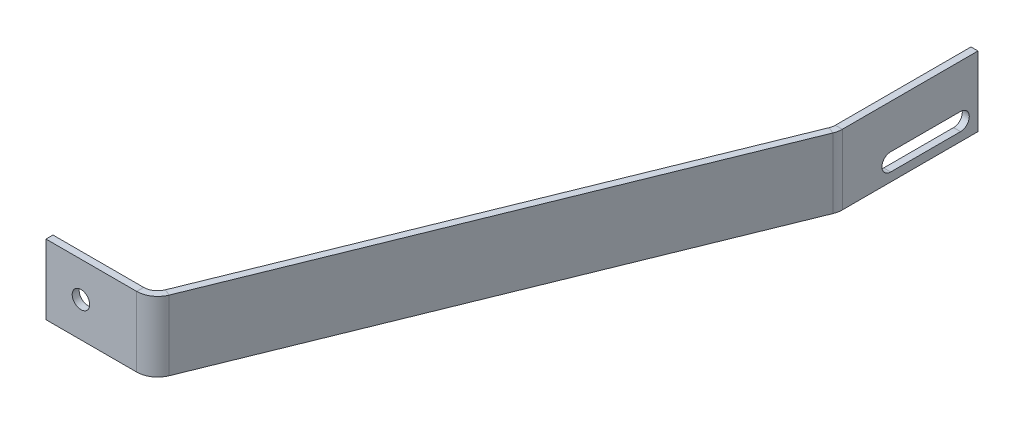
ISO-10303-21;
HEADER;
FILE_DESCRIPTION(('STEP AP214'),'2;1');
FILE_NAME('part.step','',(''),(''),'','','');
FILE_SCHEMA(('AUTOMOTIVE_DESIGN { 1 0 10303 214 1 1 1 1 }'));
ENDSEC;
DATA;
#1=APPLICATION_CONTEXT('core data for automotive mechanical design processes');
#2=APPLICATION_PROTOCOL_DEFINITION('international standard','automotive_design',2000,#1);
#3=PRODUCT_CONTEXT('',#1,'mechanical');
#4=PRODUCT('Part','Part','',(#3));
#5=PRODUCT_RELATED_PRODUCT_CATEGORY('part','',(#4));
#6=PRODUCT_DEFINITION_FORMATION('','',#4);
#7=PRODUCT_DEFINITION_CONTEXT('part definition',#1,'design');
#8=PRODUCT_DEFINITION('design','',#6,#7);
#9=PRODUCT_DEFINITION_SHAPE('','',#8);
#10=(LENGTH_UNIT() NAMED_UNIT(*) SI_UNIT(.MILLI.,.METRE.));
#11=(NAMED_UNIT(*) PLANE_ANGLE_UNIT() SI_UNIT($,.RADIAN.));
#12=(NAMED_UNIT(*) SI_UNIT($,.STERADIAN.) SOLID_ANGLE_UNIT());
#13=UNCERTAINTY_MEASURE_WITH_UNIT(LENGTH_MEASURE(1.E-05),#10,'distance_accuracy_value','');
#14=(GEOMETRIC_REPRESENTATION_CONTEXT(3) GLOBAL_UNCERTAINTY_ASSIGNED_CONTEXT((#13)) GLOBAL_UNIT_ASSIGNED_CONTEXT((#10,
#11,#12)) REPRESENTATION_CONTEXT('',''));
#15=CARTESIAN_POINT('',(0.,0.,0.));
#16=DIRECTION('',(0.,0.,1.));
#17=DIRECTION('',(1.,0.,0.));
#18=AXIS2_PLACEMENT_3D('',#15,#16,#17);
#19=CARTESIAN_POINT('',(86.75,20.,-140.));
#20=DIRECTION('',(-1.,0.,0.));
#21=DIRECTION('',(0.,0.,1.));
#22=AXIS2_PLACEMENT_3D('',#19,#20,#21);
#23=PLANE('',#22);
#24=DIRECTION('',(0.,0.,-1.));
#25=VECTOR('',#24,1.);
#26=CARTESIAN_POINT('',(86.75,20.,-140.));
#27=LINE('',#26,#25);
#28=CARTESIAN_POINT('',(86.75,20.,-141.169842742062));
#29=VERTEX_POINT('',#28);
#30=CARTESIAN_POINT('',(86.75,20.,-180.));
#31=VERTEX_POINT('',#30);
#32=EDGE_CURVE('E227',#29,#31,#27,.T.);
#33=ORIENTED_EDGE('',*,*,#32,.F.);
#34=DIRECTION('',(0.,-1.,0.));
#35=VECTOR('',#34,1.);
#36=CARTESIAN_POINT('',(86.75,20.,-141.169842742062));
#37=LINE('',#36,#35);
#38=CARTESIAN_POINT('',(86.75,0.,-141.169842742062));
#39=VERTEX_POINT('',#38);
#40=EDGE_CURVE('E239',#29,#39,#37,.T.);
#41=ORIENTED_EDGE('',*,*,#40,.T.);
#42=DIRECTION('',(0.,0.,-1.));
#43=VECTOR('',#42,1.);
#44=CARTESIAN_POINT('',(86.75,0.,-140.));
#45=LINE('',#44,#43);
#46=CARTESIAN_POINT('',(86.75,0.,-180.));
#47=VERTEX_POINT('',#46);
#48=EDGE_CURVE('E219',#39,#47,#45,.T.);
#49=ORIENTED_EDGE('',*,*,#48,.T.);
#50=DIRECTION('',(0.,-1.,0.));
#51=VECTOR('',#50,1.);
#52=CARTESIAN_POINT('',(86.75,20.,-180.));
#53=LINE('',#52,#51);
#54=EDGE_CURVE('E223',#31,#47,#53,.T.);
#55=ORIENTED_EDGE('',*,*,#54,.F.);
#56=EDGE_LOOP('',(#33,#41,#49,#55));
#57=FACE_BOUND('',#56,.T.);
#58=CARTESIAN_POINT('',(86.75,5.00000000000001,-175.));
#59=DIRECTION('',(-1.,0.,0.));
#60=DIRECTION('',(0.,0.,1.));
#61=AXIS2_PLACEMENT_3D('',#58,#59,#60);
#62=CIRCLE('',#61,2.5);
#63=CARTESIAN_POINT('',(86.75,7.50000000000001,-175.));
#64=VERTEX_POINT('',#63);
#65=CARTESIAN_POINT('',(86.75,2.50000000000001,-175.));
#66=VERTEX_POINT('',#65);
#67=EDGE_CURVE('E62',#64,#66,#62,.T.);
#68=ORIENTED_EDGE('',*,*,#67,.T.);
#69=DIRECTION('',(0.,0.,1.));
#70=VECTOR('',#69,1.);
#71=CARTESIAN_POINT('',(86.75,2.50000000000001,-175.));
#72=LINE('',#71,#70);
#73=CARTESIAN_POINT('',(86.75,2.50000000000001,-155.));
#74=VERTEX_POINT('',#73);
#75=EDGE_CURVE('E169',#66,#74,#72,.T.);
#76=ORIENTED_EDGE('',*,*,#75,.T.);
#77=CARTESIAN_POINT('',(86.75,5.00000000000001,-155.));
#78=DIRECTION('',(-1.,0.,0.));
#79=DIRECTION('',(0.,0.,1.));
#80=AXIS2_PLACEMENT_3D('',#77,#78,#79);
#81=CIRCLE('',#80,2.5);
#82=CARTESIAN_POINT('',(86.75,7.50000000000001,-155.));
#83=VERTEX_POINT('',#82);
#84=EDGE_CURVE('E176',#74,#83,#81,.T.);
#85=ORIENTED_EDGE('',*,*,#84,.T.);
#86=DIRECTION('',(0.,0.,-1.));
#87=VECTOR('',#86,1.);
#88=CARTESIAN_POINT('',(86.75,7.50000000000001,-175.));
#89=LINE('',#88,#87);
#90=EDGE_CURVE('E179',#83,#64,#89,.T.);
#91=ORIENTED_EDGE('',*,*,#90,.T.);
#92=EDGE_LOOP('',(#68,#76,#85,#91));
#93=FACE_BOUND('',#92,.T.);
#94=ADVANCED_FACE('F46',(#57,#93),#23,.F.);
#95=CARTESIAN_POINT('',(84.75,20.,-140.));
#96=DIRECTION('',(-1.,0.,0.));
#97=DIRECTION('',(0.,0.,1.));
#98=AXIS2_PLACEMENT_3D('',#95,#96,#97);
#99=PLANE('',#98);
#100=DIRECTION('',(0.,0.,1.));
#101=VECTOR('',#100,1.);
#102=CARTESIAN_POINT('',(84.75,20.,-140.));
#103=LINE('',#102,#101);
#104=CARTESIAN_POINT('',(84.75,20.,-141.169842742062));
#105=VERTEX_POINT('',#104);
#106=CARTESIAN_POINT('',(84.75,20.,-180.));
#107=VERTEX_POINT('',#106);
#108=EDGE_CURVE('E276',#105,#107,#103,.F.);
#109=ORIENTED_EDGE('',*,*,#108,.T.);
#110=DIRECTION('',(0.,1.,0.));
#111=VECTOR('',#110,1.);
#112=CARTESIAN_POINT('',(84.75,20.,-180.));
#113=LINE('',#112,#111);
#114=CARTESIAN_POINT('',(84.75,0.,-180.));
#115=VERTEX_POINT('',#114);
#116=EDGE_CURVE('E283',#107,#115,#113,.F.);
#117=ORIENTED_EDGE('',*,*,#116,.T.);
#118=DIRECTION('',(0.,0.,1.));
#119=VECTOR('',#118,1.);
#120=CARTESIAN_POINT('',(84.75,0.,-140.));
#121=LINE('',#120,#119);
#122=CARTESIAN_POINT('',(84.75,0.,-141.169842742062));
#123=VERTEX_POINT('',#122);
#124=EDGE_CURVE('E287',#123,#115,#121,.F.);
#125=ORIENTED_EDGE('',*,*,#124,.F.);
#126=DIRECTION('',(0.,1.,0.));
#127=VECTOR('',#126,1.);
#128=CARTESIAN_POINT('',(84.75,20.,-141.169842742062));
#129=LINE('',#128,#127);
#130=EDGE_CURVE('E264',#105,#123,#129,.F.);
#131=ORIENTED_EDGE('',*,*,#130,.F.);
#132=EDGE_LOOP('',(#109,#117,#125,#131));
#133=FACE_BOUND('',#132,.T.);
#134=DIRECTION('',(0.,0.,-1.));
#135=VECTOR('',#134,1.);
#136=CARTESIAN_POINT('',(84.75,2.50000000000001,-140.));
#137=LINE('',#136,#135);
#138=CARTESIAN_POINT('',(84.75,2.50000000000001,-155.));
#139=VERTEX_POINT('',#138);
#140=CARTESIAN_POINT('',(84.75,2.50000000000001,-175.));
#141=VERTEX_POINT('',#140);
#142=EDGE_CURVE('E55',#139,#141,#137,.T.);
#143=ORIENTED_EDGE('',*,*,#142,.T.);
#144=CARTESIAN_POINT('',(84.75,5.00000000000001,-175.));
#145=DIRECTION('',(-1.,0.,0.));
#146=DIRECTION('',(0.,0.,1.));
#147=AXIS2_PLACEMENT_3D('',#144,#145,#146);
#148=CIRCLE('',#147,2.5);
#149=CARTESIAN_POINT('',(84.75,7.50000000000001,-175.));
#150=VERTEX_POINT('',#149);
#151=EDGE_CURVE('E11',#141,#150,#148,.F.);
#152=ORIENTED_EDGE('',*,*,#151,.T.);
#153=DIRECTION('',(0.,0.,1.));
#154=VECTOR('',#153,1.);
#155=CARTESIAN_POINT('',(84.75,7.50000000000001,-140.));
#156=LINE('',#155,#154);
#157=CARTESIAN_POINT('',(84.75,7.50000000000001,-155.));
#158=VERTEX_POINT('',#157);
#159=EDGE_CURVE('E360',#150,#158,#156,.T.);
#160=ORIENTED_EDGE('',*,*,#159,.T.);
#161=CARTESIAN_POINT('',(84.75,5.00000000000001,-155.));
#162=DIRECTION('',(-1.,0.,0.));
#163=DIRECTION('',(0.,0.,1.));
#164=AXIS2_PLACEMENT_3D('',#161,#162,#163);
#165=CIRCLE('',#164,2.5);
#166=EDGE_CURVE('E369',#158,#139,#165,.F.);
#167=ORIENTED_EDGE('',*,*,#166,.T.);
#168=EDGE_LOOP('',(#143,#152,#160,#167));
#169=FACE_BOUND('',#168,.T.);
#170=ADVANCED_FACE('F374',(#133,#169),#99,.T.);
#171=CARTESIAN_POINT('',(30.,20.,0.));
#172=DIRECTION('',(0.,1.,0.));
#173=DIRECTION('',(0.375666694353558,0.,-0.926754840696001));
#174=AXIS2_PLACEMENT_3D('',#171,#172,#173);
#175=PLANE('',#174);
#176=DIRECTION('',(0.926754840696001,0.,0.375666694353558));
#177=VECTOR('',#176,1.);
#178=CARTESIAN_POINT('',(86.310529044176,20.,-138.915842575941));
#179=LINE('',#178,#177);
#180=CARTESIAN_POINT('',(84.457019362784,20.,-139.667175964648));
#181=VERTEX_POINT('',#180);
#182=CARTESIAN_POINT('',(86.310529044176,20.,-138.915842575941));
#183=VERTEX_POINT('',#182);
#184=EDGE_CURVE('E357',#181,#183,#179,.T.);
#185=ORIENTED_EDGE('',*,*,#184,.F.);
#186=DIRECTION('',(-0.375666694353558,0.,0.926754840696001));
#187=VECTOR('',#186,1.);
#188=CARTESIAN_POINT('',(28.146490318608,20.,-0.751333388707115));
#189=LINE('',#188,#187);
#190=CARTESIAN_POINT('',(29.6649581084124,20.,-4.49733322258577));
#191=VERTEX_POINT('',#190);
#192=EDGE_CURVE('E301',#191,#181,#189,.F.);
#193=ORIENTED_EDGE('',*,*,#192,.F.);
#194=DIRECTION('',(0.926754840696001,0.,0.375666694353557));
#195=VECTOR('',#194,1.);
#196=CARTESIAN_POINT('',(31.5184677898044,20.,-3.74599983387866));
#197=LINE('',#196,#195);
#198=CARTESIAN_POINT('',(31.5184677898044,20.,-3.74599983387866));
#199=VERTEX_POINT('',#198);
#200=EDGE_CURVE('E354',#191,#199,#197,.T.);
#201=ORIENTED_EDGE('',*,*,#200,.T.);
#202=DIRECTION('',(0.375666694353558,0.,-0.926754840696001));
#203=VECTOR('',#202,1.);
#204=CARTESIAN_POINT('',(30.,20.,0.));
#205=LINE('',#204,#203);
#206=EDGE_CURVE('E202',#199,#183,#205,.T.);
#207=ORIENTED_EDGE('',*,*,#206,.T.);
#208=EDGE_LOOP('',(#185,#193,#201,#207));
#209=FACE_BOUND('',#208,.T.);
#210=ADVANCED_FACE('F391',(#209),#175,.T.);
#211=CARTESIAN_POINT('',(25.9579387456284,20.,-6.));
#212=DIRECTION('',(0.,-1.,0.));
#213=DIRECTION('',(0.,0.,-1.));
#214=AXIS2_PLACEMENT_3D('',#211,#212,#213);
#215=PLANE('',#214);
#216=ORIENTED_EDGE('',*,*,#200,.F.);
#217=CARTESIAN_POINT('',(25.9579387456284,20.,-6.));
#218=DIRECTION('',(0.,-1.,0.));
#219=DIRECTION('',(0.,0.,-1.));
#220=AXIS2_PLACEMENT_3D('',#217,#218,#219);
#221=CIRCLE('',#220,4.);
#222=CARTESIAN_POINT('',(25.9579387456284,20.,-2.));
#223=VERTEX_POINT('',#222);
#224=EDGE_CURVE('E302',#191,#223,#221,.T.);
#225=ORIENTED_EDGE('',*,*,#224,.T.);
#226=DIRECTION('',(0.,0.,1.));
#227=VECTOR('',#226,1.);
#228=CARTESIAN_POINT('',(25.9579387456284,20.,0.));
#229=LINE('',#228,#227);
#230=CARTESIAN_POINT('',(25.9579387456284,20.,0.));
#231=VERTEX_POINT('',#230);
#232=EDGE_CURVE('E351',#223,#231,#229,.T.);
#233=ORIENTED_EDGE('',*,*,#232,.T.);
#234=CARTESIAN_POINT('',(25.9579387456284,20.,-6.));
#235=DIRECTION('',(0.,1.,0.));
#236=DIRECTION('',(0.,0.,1.));
#237=AXIS2_PLACEMENT_3D('',#234,#235,#236);
#238=CIRCLE('',#237,6.);
#239=EDGE_CURVE('E203',#199,#231,#238,.F.);
#240=ORIENTED_EDGE('',*,*,#239,.F.);
#241=EDGE_LOOP('',(#216,#225,#233,#240));
#242=FACE_BOUND('',#241,.T.);
#243=ADVANCED_FACE('F460',(#242),#215,.F.);
#244=CARTESIAN_POINT('',(0.,20.,0.));
#245=DIRECTION('',(0.,1.,0.));
#246=DIRECTION('',(1.,0.,0.));
#247=AXIS2_PLACEMENT_3D('',#244,#245,#246);
#248=PLANE('',#247);
#249=ORIENTED_EDGE('',*,*,#232,.F.);
#250=DIRECTION('',(-1.,0.,0.));
#251=VECTOR('',#250,1.);
#252=CARTESIAN_POINT('',(0.,20.,-2.));
#253=LINE('',#252,#251);
#254=CARTESIAN_POINT('',(0.,20.,-2.));
#255=VERTEX_POINT('',#254);
#256=EDGE_CURVE('E311',#255,#223,#253,.F.);
#257=ORIENTED_EDGE('',*,*,#256,.F.);
#258=DIRECTION('',(0.,0.,1.));
#259=VECTOR('',#258,1.);
#260=CARTESIAN_POINT('',(0.,20.,0.));
#261=LINE('',#260,#259);
#262=CARTESIAN_POINT('',(0.,20.,0.));
#263=VERTEX_POINT('',#262);
#264=EDGE_CURVE('E348',#255,#263,#261,.T.);
#265=ORIENTED_EDGE('',*,*,#264,.T.);
#266=DIRECTION('',(1.,0.,0.));
#267=VECTOR('',#266,1.);
#268=CARTESIAN_POINT('',(0.,20.,0.));
#269=LINE('',#268,#267);
#270=EDGE_CURVE('E211',#263,#231,#269,.T.);
#271=ORIENTED_EDGE('',*,*,#270,.T.);
#272=EDGE_LOOP('',(#249,#257,#265,#271));
#273=FACE_BOUND('',#272,.T.);
#274=ADVANCED_FACE('F456',(#273),#248,.T.);
#275=CARTESIAN_POINT('',(0.,20.,0.));
#276=DIRECTION('',(1.,0.,0.));
#277=DIRECTION('',(0.,-1.,0.));
#278=AXIS2_PLACEMENT_3D('',#275,#276,#277);
#279=PLANE('',#278);
#280=ORIENTED_EDGE('',*,*,#264,.F.);
#281=DIRECTION('',(0.,1.,0.));
#282=VECTOR('',#281,1.);
#283=CARTESIAN_POINT('',(0.,20.,-2.));
#284=LINE('',#283,#282);
#285=CARTESIAN_POINT('',(0.,0.,-2.));
#286=VERTEX_POINT('',#285);
#287=EDGE_CURVE('E291',#255,#286,#284,.F.);
#288=ORIENTED_EDGE('',*,*,#287,.T.);
#289=DIRECTION('',(0.,0.,1.));
#290=VECTOR('',#289,1.);
#291=CARTESIAN_POINT('',(0.,0.,0.));
#292=LINE('',#291,#290);
#293=CARTESIAN_POINT('',(0.,0.,0.));
#294=VERTEX_POINT('',#293);
#295=EDGE_CURVE('E345',#286,#294,#292,.T.);
#296=ORIENTED_EDGE('',*,*,#295,.T.);
#297=DIRECTION('',(0.,-1.,0.));
#298=VECTOR('',#297,1.);
#299=CARTESIAN_POINT('',(0.,20.,0.));
#300=LINE('',#299,#298);
#301=EDGE_CURVE('E215',#263,#294,#300,.T.);
#302=ORIENTED_EDGE('',*,*,#301,.F.);
#303=EDGE_LOOP('',(#280,#288,#296,#302));
#304=FACE_BOUND('',#303,.T.);
#305=ADVANCED_FACE('F452',(#304),#279,.F.);
#306=CARTESIAN_POINT('',(0.,0.,0.));
#307=DIRECTION('',(0.,1.,0.));
#308=DIRECTION('',(1.,0.,0.));
#309=AXIS2_PLACEMENT_3D('',#306,#307,#308);
#310=PLANE('',#309);
#311=ORIENTED_EDGE('',*,*,#295,.F.);
#312=DIRECTION('',(-1.,0.,0.));
#313=VECTOR('',#312,1.);
#314=CARTESIAN_POINT('',(0.,0.,-2.));
#315=LINE('',#314,#313);
#316=CARTESIAN_POINT('',(25.9579387456284,0.,-2.));
#317=VERTEX_POINT('',#316);
#318=EDGE_CURVE('E307',#286,#317,#315,.F.);
#319=ORIENTED_EDGE('',*,*,#318,.T.);
#320=DIRECTION('',(0.,0.,1.));
#321=VECTOR('',#320,1.);
#322=CARTESIAN_POINT('',(25.9579387456284,0.,0.));
#323=LINE('',#322,#321);
#324=CARTESIAN_POINT('',(25.9579387456284,0.,0.));
#325=VERTEX_POINT('',#324);
#326=EDGE_CURVE('E342',#317,#325,#323,.T.);
#327=ORIENTED_EDGE('',*,*,#326,.T.);
#328=DIRECTION('',(1.,0.,0.));
#329=VECTOR('',#328,1.);
#330=CARTESIAN_POINT('',(0.,0.,0.));
#331=LINE('',#330,#329);
#332=EDGE_CURVE('E207',#294,#325,#331,.T.);
#333=ORIENTED_EDGE('',*,*,#332,.F.);
#334=EDGE_LOOP('',(#311,#319,#327,#333));
#335=FACE_BOUND('',#334,.T.);
#336=ADVANCED_FACE('F448',(#335),#310,.F.);
#337=CARTESIAN_POINT('',(25.9579387456284,0.,-6.));
#338=DIRECTION('',(0.,1.,0.));
#339=DIRECTION('',(0.,0.,1.));
#340=AXIS2_PLACEMENT_3D('',#337,#338,#339);
#341=PLANE('',#340);
#342=ORIENTED_EDGE('',*,*,#326,.F.);
#343=CARTESIAN_POINT('',(25.9579387456284,0.,-6.));
#344=DIRECTION('',(0.,-1.,0.));
#345=DIRECTION('',(0.,0.,-1.));
#346=AXIS2_PLACEMENT_3D('',#343,#344,#345);
#347=CIRCLE('',#346,4.);
#348=CARTESIAN_POINT('',(29.6649581084124,0.,-4.49733322258577));
#349=VERTEX_POINT('',#348);
#350=EDGE_CURVE('E303',#317,#349,#347,.F.);
#351=ORIENTED_EDGE('',*,*,#350,.T.);
#352=DIRECTION('',(0.926754840696001,0.,0.375666694353558));
#353=VECTOR('',#352,1.);
#354=CARTESIAN_POINT('',(31.5184677898044,0.,-3.74599983387866));
#355=LINE('',#354,#353);
#356=CARTESIAN_POINT('',(31.5184677898044,0.,-3.74599983387866));
#357=VERTEX_POINT('',#356);
#358=EDGE_CURVE('E339',#349,#357,#355,.T.);
#359=ORIENTED_EDGE('',*,*,#358,.T.);
#360=CARTESIAN_POINT('',(25.9579387456284,0.,-6.));
#361=DIRECTION('',(0.,-1.,0.));
#362=DIRECTION('',(0.,0.,-1.));
#363=AXIS2_PLACEMENT_3D('',#360,#361,#362);
#364=CIRCLE('',#363,6.);
#365=EDGE_CURVE('E240',#325,#357,#364,.F.);
#366=ORIENTED_EDGE('',*,*,#365,.F.);
#367=EDGE_LOOP('',(#342,#351,#359,#366));
#368=FACE_BOUND('',#367,.T.);
#369=ADVANCED_FACE('F444',(#368),#341,.F.);
#370=CARTESIAN_POINT('',(30.,0.,0.));
#371=DIRECTION('',(0.,1.,0.));
#372=DIRECTION('',(0.375666694353558,0.,-0.926754840696001));
#373=AXIS2_PLACEMENT_3D('',#370,#371,#372);
#374=PLANE('',#373);
#375=ORIENTED_EDGE('',*,*,#358,.F.);
#376=DIRECTION('',(-0.375666694353558,0.,0.926754840696001));
#377=VECTOR('',#376,1.);
#378=CARTESIAN_POINT('',(28.146490318608,0.,-0.751333388707115));
#379=LINE('',#378,#377);
#380=CARTESIAN_POINT('',(84.457019362784,0.,-139.667175964648));
#381=VERTEX_POINT('',#380);
#382=EDGE_CURVE('E297',#349,#381,#379,.F.);
#383=ORIENTED_EDGE('',*,*,#382,.T.);
#384=DIRECTION('',(0.926754840696,0.,0.375666694353562));
#385=VECTOR('',#384,1.);
#386=CARTESIAN_POINT('',(86.310529044176,0.,-138.915842575941));
#387=LINE('',#386,#385);
#388=CARTESIAN_POINT('',(86.310529044176,0.,-138.915842575941));
#389=VERTEX_POINT('',#388);
#390=EDGE_CURVE('E336',#381,#389,#387,.T.);
#391=ORIENTED_EDGE('',*,*,#390,.T.);
#392=DIRECTION('',(0.375666694353558,0.,-0.926754840696001));
#393=VECTOR('',#392,1.);
#394=CARTESIAN_POINT('',(30.,0.,0.));
#395=LINE('',#394,#393);
#396=EDGE_CURVE('E198',#357,#389,#395,.T.);
#397=ORIENTED_EDGE('',*,*,#396,.F.);
#398=EDGE_LOOP('',(#375,#383,#391,#397));
#399=FACE_BOUND('',#398,.T.);
#400=ADVANCED_FACE('F440',(#399),#374,.F.);
#401=CARTESIAN_POINT('',(80.75,0.,-141.169842742062));
#402=DIRECTION('',(0.,1.,0.));
#403=DIRECTION('',(0.,0.,1.));
#404=AXIS2_PLACEMENT_3D('',#401,#402,#403);
#405=PLANE('',#404);
#406=ORIENTED_EDGE('',*,*,#390,.F.);
#407=CARTESIAN_POINT('',(80.75,0.,-141.169842742062));
#408=DIRECTION('',(0.,-1.,0.));
#409=DIRECTION('',(0.,0.,-1.));
#410=AXIS2_PLACEMENT_3D('',#407,#408,#409);
#411=CIRCLE('',#410,4.);
#412=EDGE_CURVE('E292',#381,#123,#411,.F.);
#413=ORIENTED_EDGE('',*,*,#412,.T.);
#414=DIRECTION('',(1.,0.,0.));
#415=VECTOR('',#414,1.);
#416=CARTESIAN_POINT('',(86.75,0.,-141.169842742062));
#417=LINE('',#416,#415);
#418=EDGE_CURVE('E333',#123,#39,#417,.T.);
#419=ORIENTED_EDGE('',*,*,#418,.T.);
#420=CARTESIAN_POINT('',(80.75,0.,-141.169842742062));
#421=DIRECTION('',(0.,-1.,0.));
#422=DIRECTION('',(0.,0.,-1.));
#423=AXIS2_PLACEMENT_3D('',#420,#421,#422);
#424=CIRCLE('',#423,6.);
#425=EDGE_CURVE('E256',#389,#39,#424,.F.);
#426=ORIENTED_EDGE('',*,*,#425,.F.);
#427=EDGE_LOOP('',(#406,#413,#419,#426));
#428=FACE_BOUND('',#427,.T.);
#429=ADVANCED_FACE('F436',(#428),#405,.F.);
#430=CARTESIAN_POINT('',(86.75,0.,-140.));
#431=DIRECTION('',(0.,1.,0.));
#432=DIRECTION('',(0.,0.,-1.));
#433=AXIS2_PLACEMENT_3D('',#430,#431,#432);
#434=PLANE('',#433);
#435=ORIENTED_EDGE('',*,*,#418,.F.);
#436=ORIENTED_EDGE('',*,*,#124,.T.);
#437=DIRECTION('',(1.,0.,0.));
#438=VECTOR('',#437,1.);
#439=CARTESIAN_POINT('',(86.75,0.,-180.));
#440=LINE('',#439,#438);
#441=EDGE_CURVE('E330',#115,#47,#440,.T.);
#442=ORIENTED_EDGE('',*,*,#441,.T.);
#443=ORIENTED_EDGE('',*,*,#48,.F.);
#444=EDGE_LOOP('',(#435,#436,#442,#443));
#445=FACE_BOUND('',#444,.T.);
#446=ADVANCED_FACE('F432',(#445),#434,.F.);
#447=CARTESIAN_POINT('',(86.75,20.,-180.));
#448=DIRECTION('',(0.,0.,-1.));
#449=DIRECTION('',(0.,-1.,0.));
#450=AXIS2_PLACEMENT_3D('',#447,#448,#449);
#451=PLANE('',#450);
#452=ORIENTED_EDGE('',*,*,#441,.F.);
#453=ORIENTED_EDGE('',*,*,#116,.F.);
#454=DIRECTION('',(1.,0.,0.));
#455=VECTOR('',#454,1.);
#456=CARTESIAN_POINT('',(86.75,20.,-180.));
#457=LINE('',#456,#455);
#458=EDGE_CURVE('E327',#107,#31,#457,.T.);
#459=ORIENTED_EDGE('',*,*,#458,.T.);
#460=ORIENTED_EDGE('',*,*,#54,.T.);
#461=EDGE_LOOP('',(#452,#453,#459,#460));
#462=FACE_BOUND('',#461,.T.);
#463=ADVANCED_FACE('F428',(#462),#451,.T.);
#464=CARTESIAN_POINT('',(86.75,20.,-140.));
#465=DIRECTION('',(0.,1.,0.));
#466=DIRECTION('',(0.,0.,-1.));
#467=AXIS2_PLACEMENT_3D('',#464,#465,#466);
#468=PLANE('',#467);
#469=ORIENTED_EDGE('',*,*,#458,.F.);
#470=ORIENTED_EDGE('',*,*,#108,.F.);
#471=DIRECTION('',(1.,0.,0.));
#472=VECTOR('',#471,1.);
#473=CARTESIAN_POINT('',(86.75,20.,-141.169842742062));
#474=LINE('',#473,#472);
#475=EDGE_CURVE('E255',#105,#29,#474,.T.);
#476=ORIENTED_EDGE('',*,*,#475,.T.);
#477=ORIENTED_EDGE('',*,*,#32,.T.);
#478=EDGE_LOOP('',(#469,#470,#476,#477));
#479=FACE_BOUND('',#478,.T.);
#480=ADVANCED_FACE('F425',(#479),#468,.T.);
#481=CARTESIAN_POINT('',(80.75,20.,-141.169842742062));
#482=DIRECTION('',(0.,-1.,0.));
#483=DIRECTION('',(0.,0.,-1.));
#484=AXIS2_PLACEMENT_3D('',#481,#482,#483);
#485=PLANE('',#484);
#486=CARTESIAN_POINT('',(80.75,20.,-141.169842742062));
#487=DIRECTION('',(0.,-1.,0.));
#488=DIRECTION('',(0.,0.,-1.));
#489=AXIS2_PLACEMENT_3D('',#486,#487,#488);
#490=CIRCLE('',#489,4.);
#491=EDGE_CURVE('E296',#105,#181,#490,.T.);
#492=ORIENTED_EDGE('',*,*,#491,.T.);
#493=ORIENTED_EDGE('',*,*,#184,.T.);
#494=CARTESIAN_POINT('',(80.75,20.,-141.169842742062));
#495=DIRECTION('',(0.,1.,0.));
#496=DIRECTION('',(0.,0.,1.));
#497=AXIS2_PLACEMENT_3D('',#494,#495,#496);
#498=CIRCLE('',#497,6.);
#499=EDGE_CURVE('E244',#29,#183,#498,.F.);
#500=ORIENTED_EDGE('',*,*,#499,.F.);
#501=ORIENTED_EDGE('',*,*,#475,.F.);
#502=EDGE_LOOP('',(#492,#493,#500,#501));
#503=FACE_BOUND('',#502,.T.);
#504=ADVANCED_FACE('F48',(#503),#485,.F.);
#505=CARTESIAN_POINT('',(0.,20.,0.));
#506=DIRECTION('',(0.,0.,-1.));
#507=DIRECTION('',(-1.,0.,0.));
#508=AXIS2_PLACEMENT_3D('',#505,#506,#507);
#509=PLANE('',#508);
#510=CARTESIAN_POINT('',(10.,10.,0.));
#511=DIRECTION('',(0.,0.,1.));
#512=DIRECTION('',(1.,0.,0.));
#513=AXIS2_PLACEMENT_3D('',#510,#511,#512);
#514=CIRCLE('',#513,2.5);
#515=CARTESIAN_POINT('',(12.5,10.,0.));
#516=VERTEX_POINT('',#515);
#517=EDGE_CURVE('E165',#516,#516,#514,.T.);
#518=ORIENTED_EDGE('',*,*,#517,.F.);
#519=EDGE_LOOP('',(#518));
#520=FACE_BOUND('',#519,.T.);
#521=ORIENTED_EDGE('',*,*,#332,.T.);
#522=DIRECTION('',(0.,-1.,0.));
#523=VECTOR('',#522,1.);
#524=CARTESIAN_POINT('',(25.9579387456284,20.,0.));
#525=LINE('',#524,#523);
#526=EDGE_CURVE('E235',#325,#231,#525,.F.);
#527=ORIENTED_EDGE('',*,*,#526,.T.);
#528=ORIENTED_EDGE('',*,*,#270,.F.);
#529=ORIENTED_EDGE('',*,*,#301,.T.);
#530=EDGE_LOOP('',(#521,#527,#528,#529));
#531=FACE_BOUND('',#530,.T.);
#532=ADVANCED_FACE('F397',(#520,#531),#509,.F.);
#533=CARTESIAN_POINT('',(30.,20.,0.));
#534=DIRECTION('',(-0.926754840696001,0.,-0.375666694353558));
#535=DIRECTION('',(-0.375666694353558,0.,0.926754840696001));
#536=AXIS2_PLACEMENT_3D('',#533,#534,#535);
#537=PLANE('',#536);
#538=ORIENTED_EDGE('',*,*,#396,.T.);
#539=DIRECTION('',(0.,-1.,0.));
#540=VECTOR('',#539,1.);
#541=CARTESIAN_POINT('',(86.310529044176,20.,-138.915842575941));
#542=LINE('',#541,#540);
#543=EDGE_CURVE('E251',#389,#183,#542,.F.);
#544=ORIENTED_EDGE('',*,*,#543,.T.);
#545=ORIENTED_EDGE('',*,*,#206,.F.);
#546=DIRECTION('',(0.,-1.,0.));
#547=VECTOR('',#546,1.);
#548=CARTESIAN_POINT('',(31.5184677898044,20.,-3.74599983387866));
#549=LINE('',#548,#547);
#550=EDGE_CURVE('E231',#199,#357,#549,.T.);
#551=ORIENTED_EDGE('',*,*,#550,.T.);
#552=EDGE_LOOP('',(#538,#544,#545,#551));
#553=FACE_BOUND('',#552,.T.);
#554=ADVANCED_FACE('F403',(#553),#537,.F.);
#555=CARTESIAN_POINT('',(25.9579387456284,20.,-6.));
#556=DIRECTION('',(0.,-1.,0.));
#557=DIRECTION('',(0.,0.,-1.));
#558=AXIS2_PLACEMENT_3D('',#555,#556,#557);
#559=CYLINDRICAL_SURFACE('',#558,6.);
#560=ORIENTED_EDGE('',*,*,#239,.T.);
#561=ORIENTED_EDGE('',*,*,#526,.F.);
#562=ORIENTED_EDGE('',*,*,#365,.T.);
#563=ORIENTED_EDGE('',*,*,#550,.F.);
#564=EDGE_LOOP('',(#560,#561,#562,#563));
#565=FACE_BOUND('',#564,.T.);
#566=ADVANCED_FACE('F399',(#565),#559,.T.);
#567=CARTESIAN_POINT('',(80.75,20.,-141.169842742062));
#568=DIRECTION('',(0.,-1.,0.));
#569=DIRECTION('',(0.,0.,-1.));
#570=AXIS2_PLACEMENT_3D('',#567,#568,#569);
#571=CYLINDRICAL_SURFACE('',#570,6.);
#572=ORIENTED_EDGE('',*,*,#499,.T.);
#573=ORIENTED_EDGE('',*,*,#543,.F.);
#574=ORIENTED_EDGE('',*,*,#425,.T.);
#575=ORIENTED_EDGE('',*,*,#40,.F.);
#576=EDGE_LOOP('',(#572,#573,#574,#575));
#577=FACE_BOUND('',#576,.T.);
#578=ADVANCED_FACE('F402',(#577),#571,.T.);
#579=CARTESIAN_POINT('',(0.,20.,-2.));
#580=DIRECTION('',(0.,0.,-1.));
#581=DIRECTION('',(-1.,0.,0.));
#582=AXIS2_PLACEMENT_3D('',#579,#580,#581);
#583=PLANE('',#582);
#584=CARTESIAN_POINT('',(10.,10.,-2.));
#585=DIRECTION('',(0.,0.,-1.));
#586=DIRECTION('',(-1.,0.,0.));
#587=AXIS2_PLACEMENT_3D('',#584,#585,#586);
#588=CIRCLE('',#587,2.5);
#589=CARTESIAN_POINT('',(7.5,10.,-2.));
#590=VERTEX_POINT('',#589);
#591=EDGE_CURVE('E197',#590,#590,#588,.T.);
#592=ORIENTED_EDGE('',*,*,#591,.F.);
#593=EDGE_LOOP('',(#592));
#594=FACE_BOUND('',#593,.T.);
#595=ORIENTED_EDGE('',*,*,#318,.F.);
#596=ORIENTED_EDGE('',*,*,#287,.F.);
#597=ORIENTED_EDGE('',*,*,#256,.T.);
#598=DIRECTION('',(0.,1.,0.));
#599=VECTOR('',#598,1.);
#600=CARTESIAN_POINT('',(25.9579387456284,20.,-2.));
#601=LINE('',#600,#599);
#602=EDGE_CURVE('E268',#317,#223,#601,.T.);
#603=ORIENTED_EDGE('',*,*,#602,.F.);
#604=EDGE_LOOP('',(#595,#596,#597,#603));
#605=FACE_BOUND('',#604,.T.);
#606=ADVANCED_FACE('F406',(#594,#605),#583,.T.);
#607=CARTESIAN_POINT('',(28.146490318608,20.,-0.751333388707115));
#608=DIRECTION('',(-0.926754840696001,0.,-0.375666694353558));
#609=DIRECTION('',(-0.375666694353558,0.,0.926754840696001));
#610=AXIS2_PLACEMENT_3D('',#607,#608,#609);
#611=PLANE('',#610);
#612=ORIENTED_EDGE('',*,*,#382,.F.);
#613=DIRECTION('',(0.,1.,0.));
#614=VECTOR('',#613,1.);
#615=CARTESIAN_POINT('',(29.6649581084124,20.,-4.49733322258577));
#616=LINE('',#615,#614);
#617=EDGE_CURVE('E272',#191,#349,#616,.F.);
#618=ORIENTED_EDGE('',*,*,#617,.F.);
#619=ORIENTED_EDGE('',*,*,#192,.T.);
#620=DIRECTION('',(0.,1.,0.));
#621=VECTOR('',#620,1.);
#622=CARTESIAN_POINT('',(84.457019362784,20.,-139.667175964648));
#623=LINE('',#622,#621);
#624=EDGE_CURVE('E260',#381,#181,#623,.T.);
#625=ORIENTED_EDGE('',*,*,#624,.F.);
#626=EDGE_LOOP('',(#612,#618,#619,#625));
#627=FACE_BOUND('',#626,.T.);
#628=ADVANCED_FACE('F411',(#627),#611,.T.);
#629=CARTESIAN_POINT('',(25.9579387456284,20.,-6.));
#630=DIRECTION('',(0.,-1.,0.));
#631=DIRECTION('',(0.,0.,-1.));
#632=AXIS2_PLACEMENT_3D('',#629,#630,#631);
#633=CYLINDRICAL_SURFACE('',#632,4.);
#634=ORIENTED_EDGE('',*,*,#224,.F.);
#635=ORIENTED_EDGE('',*,*,#617,.T.);
#636=ORIENTED_EDGE('',*,*,#350,.F.);
#637=ORIENTED_EDGE('',*,*,#602,.T.);
#638=EDGE_LOOP('',(#634,#635,#636,#637));
#639=FACE_BOUND('',#638,.T.);
#640=ADVANCED_FACE('F415',(#639),#633,.F.);
#641=CARTESIAN_POINT('',(80.75,20.,-141.169842742062));
#642=DIRECTION('',(0.,-1.,0.));
#643=DIRECTION('',(0.,0.,-1.));
#644=AXIS2_PLACEMENT_3D('',#641,#642,#643);
#645=CYLINDRICAL_SURFACE('',#644,4.);
#646=ORIENTED_EDGE('',*,*,#491,.F.);
#647=ORIENTED_EDGE('',*,*,#130,.T.);
#648=ORIENTED_EDGE('',*,*,#412,.F.);
#649=ORIENTED_EDGE('',*,*,#624,.T.);
#650=EDGE_LOOP('',(#646,#647,#648,#649));
#651=FACE_BOUND('',#650,.T.);
#652=ADVANCED_FACE('F419',(#651),#645,.F.);
#653=CARTESIAN_POINT('',(10.,10.,-20.));
#654=DIRECTION('',(0.,0.,1.));
#655=DIRECTION('',(1.,0.,0.));
#656=AXIS2_PLACEMENT_3D('',#653,#654,#655);
#657=CYLINDRICAL_SURFACE('',#656,2.5);
#658=ORIENTED_EDGE('',*,*,#591,.T.);
#659=EDGE_LOOP('',(#658));
#660=FACE_BOUND('',#659,.T.);
#661=ORIENTED_EDGE('',*,*,#517,.T.);
#662=EDGE_LOOP('',(#661));
#663=FACE_BOUND('',#662,.T.);
#664=ADVANCED_FACE('F423',(#660,#663),#657,.F.);
#665=CARTESIAN_POINT('',(76.75,5.00000000000001,-175.));
#666=DIRECTION('',(1.,0.,0.));
#667=DIRECTION('',(0.,0.,-1.));
#668=AXIS2_PLACEMENT_3D('',#665,#666,#667);
#669=CYLINDRICAL_SURFACE('',#668,2.5);
#670=DIRECTION('',(1.,0.,0.));
#671=VECTOR('',#670,1.);
#672=CARTESIAN_POINT('',(76.75,2.50000000000001,-175.));
#673=LINE('',#672,#671);
#674=EDGE_CURVE('E159',#141,#66,#673,.T.);
#675=ORIENTED_EDGE('',*,*,#674,.T.);
#676=ORIENTED_EDGE('',*,*,#67,.F.);
#677=DIRECTION('',(1.,0.,0.));
#678=VECTOR('',#677,1.);
#679=CARTESIAN_POINT('',(76.75,7.50000000000001,-175.));
#680=LINE('',#679,#678);
#681=EDGE_CURVE('E187',#150,#64,#680,.T.);
#682=ORIENTED_EDGE('',*,*,#681,.F.);
#683=ORIENTED_EDGE('',*,*,#151,.F.);
#684=EDGE_LOOP('',(#675,#676,#682,#683));
#685=FACE_BOUND('',#684,.T.);
#686=ADVANCED_FACE('F161',(#685),#669,.F.);
#687=CARTESIAN_POINT('',(76.75,2.50000000000001,-175.));
#688=DIRECTION('',(0.,1.,0.));
#689=DIRECTION('',(0.,0.,1.));
#690=AXIS2_PLACEMENT_3D('',#687,#688,#689);
#691=PLANE('',#690);
#692=DIRECTION('',(1.,0.,0.));
#693=VECTOR('',#692,1.);
#694=CARTESIAN_POINT('',(76.75,2.50000000000001,-155.));
#695=LINE('',#694,#693);
#696=EDGE_CURVE('E166',#139,#74,#695,.T.);
#697=ORIENTED_EDGE('',*,*,#696,.T.);
#698=ORIENTED_EDGE('',*,*,#75,.F.);
#699=ORIENTED_EDGE('',*,*,#674,.F.);
#700=ORIENTED_EDGE('',*,*,#142,.F.);
#701=EDGE_LOOP('',(#697,#698,#699,#700));
#702=FACE_BOUND('',#701,.T.);
#703=ADVANCED_FACE('F170',(#702),#691,.T.);
#704=CARTESIAN_POINT('',(76.75,5.00000000000001,-155.));
#705=DIRECTION('',(1.,0.,0.));
#706=DIRECTION('',(0.,0.,-1.));
#707=AXIS2_PLACEMENT_3D('',#704,#705,#706);
#708=CYLINDRICAL_SURFACE('',#707,2.5);
#709=DIRECTION('',(1.,0.,0.));
#710=VECTOR('',#709,1.);
#711=CARTESIAN_POINT('',(76.75,7.50000000000001,-155.));
#712=LINE('',#711,#710);
#713=EDGE_CURVE('E70',#158,#83,#712,.T.);
#714=ORIENTED_EDGE('',*,*,#713,.T.);
#715=ORIENTED_EDGE('',*,*,#84,.F.);
#716=ORIENTED_EDGE('',*,*,#696,.F.);
#717=ORIENTED_EDGE('',*,*,#166,.F.);
#718=EDGE_LOOP('',(#714,#715,#716,#717));
#719=FACE_BOUND('',#718,.T.);
#720=ADVANCED_FACE('F376',(#719),#708,.F.);
#721=CARTESIAN_POINT('',(76.75,7.50000000000001,-175.));
#722=DIRECTION('',(0.,-1.,0.));
#723=DIRECTION('',(0.,0.,-1.));
#724=AXIS2_PLACEMENT_3D('',#721,#722,#723);
#725=PLANE('',#724);
#726=ORIENTED_EDGE('',*,*,#681,.T.);
#727=ORIENTED_EDGE('',*,*,#90,.F.);
#728=ORIENTED_EDGE('',*,*,#713,.F.);
#729=ORIENTED_EDGE('',*,*,#159,.F.);
#730=EDGE_LOOP('',(#726,#727,#728,#729));
#731=FACE_BOUND('',#730,.T.);
#732=ADVANCED_FACE('F377',(#731),#725,.T.);
#733=CLOSED_SHELL('',(#94,#170,#210,#243,#274,#305,#336,#369,#400,#429,#446,#463,#480,#504,#532,
#554,#566,#578,#606,#628,#640,#652,#664,#686,#703,#720,#732));
#734=MANIFOLD_SOLID_BREP('B2',#733);
#735=ADVANCED_BREP_SHAPE_REPRESENTATION('',(#18,#734),#14);
#736=SHAPE_DEFINITION_REPRESENTATION(#9,#735);
ENDSEC;
END-ISO-10303-21;
